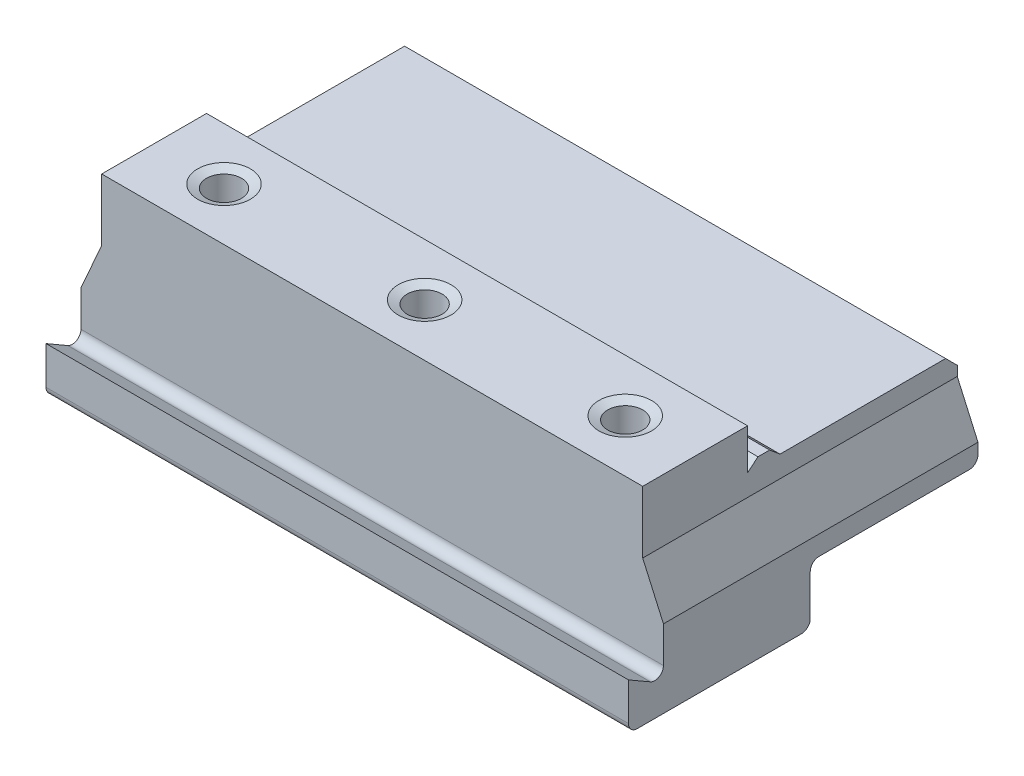
ISO-10303-21;
HEADER;
FILE_DESCRIPTION(('STEP AP214'),'2;1');
FILE_NAME('part.step','',(''),(''),'','','');
FILE_SCHEMA(('AUTOMOTIVE_DESIGN { 1 0 10303 214 1 1 1 1 }'));
ENDSEC;
DATA;
#1=APPLICATION_CONTEXT('core data for automotive mechanical design processes');
#2=APPLICATION_PROTOCOL_DEFINITION('international standard','automotive_design',2000,#1);
#3=PRODUCT_CONTEXT('',#1,'mechanical');
#4=PRODUCT('Part','Part','',(#3));
#5=PRODUCT_RELATED_PRODUCT_CATEGORY('part','',(#4));
#6=PRODUCT_DEFINITION_FORMATION('','',#4);
#7=PRODUCT_DEFINITION_CONTEXT('part definition',#1,'design');
#8=PRODUCT_DEFINITION('design','',#6,#7);
#9=PRODUCT_DEFINITION_SHAPE('','',#8);
#10=(LENGTH_UNIT() NAMED_UNIT(*) SI_UNIT(.MILLI.,.METRE.));
#11=(NAMED_UNIT(*) PLANE_ANGLE_UNIT() SI_UNIT($,.RADIAN.));
#12=(NAMED_UNIT(*) SI_UNIT($,.STERADIAN.) SOLID_ANGLE_UNIT());
#13=UNCERTAINTY_MEASURE_WITH_UNIT(LENGTH_MEASURE(1.E-05),#10,'distance_accuracy_value','');
#14=(GEOMETRIC_REPRESENTATION_CONTEXT(3) GLOBAL_UNCERTAINTY_ASSIGNED_CONTEXT((#13)) GLOBAL_UNIT_ASSIGNED_CONTEXT((#10,
#11,#12)) REPRESENTATION_CONTEXT('',''));
#15=CARTESIAN_POINT('',(0.,0.,0.));
#16=DIRECTION('',(0.,0.,1.));
#17=DIRECTION('',(1.,0.,0.));
#18=AXIS2_PLACEMENT_3D('',#15,#16,#17);
#19=CARTESIAN_POINT('',(100.,-11.4150635094611,2.25));
#20=DIRECTION('',(0.,-0.866025403784436,0.500000000000005));
#21=DIRECTION('',(0.,-0.500000000000005,-0.866025403784436));
#22=AXIS2_PLACEMENT_3D('',#19,#20,#21);
#23=PLANE('',#22);
#24=DIRECTION('',(0.,0.500000000000005,0.866025403784436));
#25=VECTOR('',#24,1.);
#26=CARTESIAN_POINT('',(0.,-11.4150635094611,2.25));
#27=LINE('',#26,#25);
#28=CARTESIAN_POINT('',(0.,-11.4150635094611,2.25));
#29=VERTEX_POINT('',#28);
#30=CARTESIAN_POINT('',(0.,-9.25000000000001,6.));
#31=VERTEX_POINT('',#30);
#32=EDGE_CURVE('E281',#29,#31,#27,.T.);
#33=ORIENTED_EDGE('',*,*,#32,.T.);
#34=DIRECTION('',(-1.,0.,0.));
#35=VECTOR('',#34,1.);
#36=CARTESIAN_POINT('',(100.,-9.25000000000001,6.));
#37=LINE('',#36,#35);
#38=CARTESIAN_POINT('',(100.,-9.25000000000001,6.));
#39=VERTEX_POINT('',#38);
#40=EDGE_CURVE('E387',#39,#31,#37,.T.);
#41=ORIENTED_EDGE('',*,*,#40,.F.);
#42=DIRECTION('',(0.,0.500000000000005,0.866025403784436));
#43=VECTOR('',#42,1.);
#44=CARTESIAN_POINT('',(100.,-11.4150635094611,2.25));
#45=LINE('',#44,#43);
#46=CARTESIAN_POINT('',(100.,-11.4150635094611,2.25));
#47=VERTEX_POINT('',#46);
#48=EDGE_CURVE('E282',#47,#39,#45,.T.);
#49=ORIENTED_EDGE('',*,*,#48,.F.);
#50=DIRECTION('',(-1.,0.,0.));
#51=VECTOR('',#50,1.);
#52=CARTESIAN_POINT('',(100.,-11.4150635094611,2.25));
#53=LINE('',#52,#51);
#54=EDGE_CURVE('E309',#47,#29,#53,.T.);
#55=ORIENTED_EDGE('',*,*,#54,.T.);
#56=EDGE_LOOP('',(#33,#41,#49,#55));
#57=FACE_BOUND('',#56,.T.);
#58=ADVANCED_FACE('F35',(#57),#23,.F.);
#59=CARTESIAN_POINT('',(100.,-9.25000000000001,6.));
#60=DIRECTION('',(0.,0.,-1.));
#61=DIRECTION('',(-1.,0.,0.));
#62=AXIS2_PLACEMENT_3D('',#59,#60,#61);
#63=PLANE('',#62);
#64=DIRECTION('',(0.,-1.,0.));
#65=VECTOR('',#64,1.);
#66=CARTESIAN_POINT('',(0.,-9.25000000000001,6.));
#67=LINE('',#66,#65);
#68=CARTESIAN_POINT('',(0.,-15.75,6.));
#69=VERTEX_POINT('',#68);
#70=EDGE_CURVE('E312',#31,#69,#67,.T.);
#71=ORIENTED_EDGE('',*,*,#70,.T.);
#72=DIRECTION('',(-1.,0.,0.));
#73=VECTOR('',#72,1.);
#74=CARTESIAN_POINT('',(100.,-15.75,6.));
#75=LINE('',#74,#73);
#76=CARTESIAN_POINT('',(100.,-15.75,6.));
#77=VERTEX_POINT('',#76);
#78=EDGE_CURVE('E384',#77,#69,#75,.T.);
#79=ORIENTED_EDGE('',*,*,#78,.F.);
#80=DIRECTION('',(0.,-1.,0.));
#81=VECTOR('',#80,1.);
#82=CARTESIAN_POINT('',(100.,-9.25000000000001,6.));
#83=LINE('',#82,#81);
#84=EDGE_CURVE('E285',#39,#77,#83,.T.);
#85=ORIENTED_EDGE('',*,*,#84,.F.);
#86=ORIENTED_EDGE('',*,*,#40,.T.);
#87=EDGE_LOOP('',(#71,#79,#85,#86));
#88=FACE_BOUND('',#87,.T.);
#89=ADVANCED_FACE('F426',(#88),#63,.F.);
#90=CARTESIAN_POINT('',(100.,-15.75,4.5));
#91=DIRECTION('',(-1.,0.,0.));
#92=DIRECTION('',(0.,0.,1.));
#93=AXIS2_PLACEMENT_3D('',#90,#91,#92);
#94=CYLINDRICAL_SURFACE('',#93,1.5);
#95=CARTESIAN_POINT('',(0.,-15.75,4.5));
#96=DIRECTION('',(1.,0.,0.));
#97=DIRECTION('',(0.,0.,-1.));
#98=AXIS2_PLACEMENT_3D('',#95,#96,#97);
#99=CIRCLE('',#98,1.5);
#100=CARTESIAN_POINT('',(0.,-17.25,4.5));
#101=VERTEX_POINT('',#100);
#102=EDGE_CURVE('E314',#69,#101,#99,.T.);
#103=ORIENTED_EDGE('',*,*,#102,.T.);
#104=DIRECTION('',(-1.,0.,0.));
#105=VECTOR('',#104,1.);
#106=CARTESIAN_POINT('',(100.,-17.25,4.5));
#107=LINE('',#106,#105);
#108=CARTESIAN_POINT('',(100.,-17.25,4.5));
#109=VERTEX_POINT('',#108);
#110=EDGE_CURVE('E381',#109,#101,#107,.T.);
#111=ORIENTED_EDGE('',*,*,#110,.F.);
#112=CARTESIAN_POINT('',(100.,-15.75,4.5));
#113=DIRECTION('',(1.,0.,0.));
#114=DIRECTION('',(0.,0.,-1.));
#115=AXIS2_PLACEMENT_3D('',#112,#113,#114);
#116=CIRCLE('',#115,1.5);
#117=EDGE_CURVE('E288',#77,#109,#116,.T.);
#118=ORIENTED_EDGE('',*,*,#117,.F.);
#119=ORIENTED_EDGE('',*,*,#78,.T.);
#120=EDGE_LOOP('',(#103,#111,#118,#119));
#121=FACE_BOUND('',#120,.T.);
#122=ADVANCED_FACE('F432',(#121),#94,.T.);
#123=CARTESIAN_POINT('',(100.,-17.25,4.5));
#124=DIRECTION('',(0.,1.,0.));
#125=DIRECTION('',(0.,0.,1.));
#126=AXIS2_PLACEMENT_3D('',#123,#124,#125);
#127=PLANE('',#126);
#128=DIRECTION('',(0.,0.,-1.));
#129=VECTOR('',#128,1.);
#130=CARTESIAN_POINT('',(0.,-17.25,4.5));
#131=LINE('',#130,#129);
#132=CARTESIAN_POINT('',(0.,-17.25,-23.7));
#133=VERTEX_POINT('',#132);
#134=EDGE_CURVE('E316',#101,#133,#131,.T.);
#135=ORIENTED_EDGE('',*,*,#134,.T.);
#136=DIRECTION('',(-1.,0.,0.));
#137=VECTOR('',#136,1.);
#138=CARTESIAN_POINT('',(100.,-17.25,-23.7));
#139=LINE('',#138,#137);
#140=CARTESIAN_POINT('',(100.,-17.25,-23.7));
#141=VERTEX_POINT('',#140);
#142=EDGE_CURVE('E378',#141,#133,#139,.T.);
#143=ORIENTED_EDGE('',*,*,#142,.F.);
#144=DIRECTION('',(0.,0.,-1.));
#145=VECTOR('',#144,1.);
#146=CARTESIAN_POINT('',(100.,-17.25,4.5));
#147=LINE('',#146,#145);
#148=EDGE_CURVE('E290',#109,#141,#147,.T.);
#149=ORIENTED_EDGE('',*,*,#148,.F.);
#150=ORIENTED_EDGE('',*,*,#110,.T.);
#151=EDGE_LOOP('',(#135,#143,#149,#150));
#152=FACE_BOUND('',#151,.T.);
#153=ADVANCED_FACE('F445',(#152),#127,.F.);
#154=CARTESIAN_POINT('',(100.,-15.75,-23.7));
#155=DIRECTION('',(-1.,0.,0.));
#156=DIRECTION('',(0.,0.,1.));
#157=AXIS2_PLACEMENT_3D('',#154,#155,#156);
#158=CYLINDRICAL_SURFACE('',#157,1.5);
#159=CARTESIAN_POINT('',(0.,-15.75,-23.7));
#160=DIRECTION('',(1.,0.,0.));
#161=DIRECTION('',(0.,0.,-1.));
#162=AXIS2_PLACEMENT_3D('',#159,#160,#161);
#163=CIRCLE('',#162,1.5);
#164=CARTESIAN_POINT('',(0.,-15.75,-25.2));
#165=VERTEX_POINT('',#164);
#166=EDGE_CURVE('E318',#133,#165,#163,.T.);
#167=ORIENTED_EDGE('',*,*,#166,.T.);
#168=DIRECTION('',(-1.,0.,0.));
#169=VECTOR('',#168,1.);
#170=CARTESIAN_POINT('',(100.,-15.75,-25.2));
#171=LINE('',#170,#169);
#172=CARTESIAN_POINT('',(100.,-15.75,-25.2));
#173=VERTEX_POINT('',#172);
#174=EDGE_CURVE('E375',#173,#165,#171,.T.);
#175=ORIENTED_EDGE('',*,*,#174,.F.);
#176=CARTESIAN_POINT('',(100.,-15.75,-23.7));
#177=DIRECTION('',(1.,0.,0.));
#178=DIRECTION('',(0.,0.,-1.));
#179=AXIS2_PLACEMENT_3D('',#176,#177,#178);
#180=CIRCLE('',#179,1.5);
#181=EDGE_CURVE('E292',#141,#173,#180,.T.);
#182=ORIENTED_EDGE('',*,*,#181,.F.);
#183=ORIENTED_EDGE('',*,*,#142,.T.);
#184=EDGE_LOOP('',(#167,#175,#182,#183));
#185=FACE_BOUND('',#184,.T.);
#186=ADVANCED_FACE('F449',(#185),#158,.T.);
#187=CARTESIAN_POINT('',(100.,-15.75,-25.2));
#188=DIRECTION('',(0.,0.,1.));
#189=DIRECTION('',(0.,-1.,0.));
#190=AXIS2_PLACEMENT_3D('',#187,#188,#189);
#191=PLANE('',#190);
#192=DIRECTION('',(0.,1.,0.));
#193=VECTOR('',#192,1.);
#194=CARTESIAN_POINT('',(0.,-15.75,-25.2));
#195=LINE('',#194,#193);
#196=CARTESIAN_POINT('',(0.,-8.75000000000001,-25.2));
#197=VERTEX_POINT('',#196);
#198=EDGE_CURVE('E320',#165,#197,#195,.T.);
#199=ORIENTED_EDGE('',*,*,#198,.T.);
#200=DIRECTION('',(-1.,0.,0.));
#201=VECTOR('',#200,1.);
#202=CARTESIAN_POINT('',(100.,-8.75000000000001,-25.2));
#203=LINE('',#202,#201);
#204=CARTESIAN_POINT('',(100.,-8.75000000000001,-25.2));
#205=VERTEX_POINT('',#204);
#206=EDGE_CURVE('E372',#205,#197,#203,.T.);
#207=ORIENTED_EDGE('',*,*,#206,.F.);
#208=DIRECTION('',(0.,1.,0.));
#209=VECTOR('',#208,1.);
#210=CARTESIAN_POINT('',(100.,-15.75,-25.2));
#211=LINE('',#210,#209);
#212=EDGE_CURVE('E294',#173,#205,#211,.T.);
#213=ORIENTED_EDGE('',*,*,#212,.F.);
#214=ORIENTED_EDGE('',*,*,#174,.T.);
#215=EDGE_LOOP('',(#199,#207,#213,#214));
#216=FACE_BOUND('',#215,.T.);
#217=ADVANCED_FACE('F453',(#216),#191,.F.);
#218=CARTESIAN_POINT('',(100.,-8.75000000000001,-26.7));
#219=DIRECTION('',(-1.,0.,0.));
#220=DIRECTION('',(0.,0.,1.));
#221=AXIS2_PLACEMENT_3D('',#218,#219,#220);
#222=CYLINDRICAL_SURFACE('',#221,1.5);
#223=CARTESIAN_POINT('',(0.,-8.75000000000001,-26.7));
#224=DIRECTION('',(-1.,0.,0.));
#225=DIRECTION('',(0.,0.,1.));
#226=AXIS2_PLACEMENT_3D('',#223,#224,#225);
#227=CIRCLE('',#226,1.5);
#228=CARTESIAN_POINT('',(0.,-7.25000000000001,-26.7));
#229=VERTEX_POINT('',#228);
#230=EDGE_CURVE('E322',#197,#229,#227,.T.);
#231=ORIENTED_EDGE('',*,*,#230,.T.);
#232=DIRECTION('',(-1.,0.,0.));
#233=VECTOR('',#232,1.);
#234=CARTESIAN_POINT('',(100.,-7.25000000000001,-26.7));
#235=LINE('',#234,#233);
#236=CARTESIAN_POINT('',(100.,-7.25000000000001,-26.7));
#237=VERTEX_POINT('',#236);
#238=EDGE_CURVE('E369',#237,#229,#235,.T.);
#239=ORIENTED_EDGE('',*,*,#238,.F.);
#240=CARTESIAN_POINT('',(100.,-8.75000000000001,-26.7));
#241=DIRECTION('',(-1.,0.,0.));
#242=DIRECTION('',(0.,0.,1.));
#243=AXIS2_PLACEMENT_3D('',#240,#241,#242);
#244=CIRCLE('',#243,1.5);
#245=EDGE_CURVE('E296',#205,#237,#244,.T.);
#246=ORIENTED_EDGE('',*,*,#245,.F.);
#247=ORIENTED_EDGE('',*,*,#206,.T.);
#248=EDGE_LOOP('',(#231,#239,#246,#247));
#249=FACE_BOUND('',#248,.T.);
#250=ADVANCED_FACE('F457',(#249),#222,.F.);
#251=CARTESIAN_POINT('',(100.,-7.25000000000001,-26.7));
#252=DIRECTION('',(0.,1.,0.));
#253=DIRECTION('',(0.,0.,1.));
#254=AXIS2_PLACEMENT_3D('',#251,#252,#253);
#255=PLANE('',#254);
#256=DIRECTION('',(0.,0.,-1.));
#257=VECTOR('',#256,1.);
#258=CARTESIAN_POINT('',(0.,-7.25000000000001,-26.7));
#259=LINE('',#258,#257);
#260=CARTESIAN_POINT('',(0.,-7.25000000000001,-52.5));
#261=VERTEX_POINT('',#260);
#262=EDGE_CURVE('E324',#229,#261,#259,.T.);
#263=ORIENTED_EDGE('',*,*,#262,.T.);
#264=DIRECTION('',(-1.,0.,0.));
#265=VECTOR('',#264,1.);
#266=CARTESIAN_POINT('',(100.,-7.25000000000001,-52.5));
#267=LINE('',#266,#265);
#268=CARTESIAN_POINT('',(100.,-7.25000000000001,-52.5));
#269=VERTEX_POINT('',#268);
#270=EDGE_CURVE('E366',#269,#261,#267,.T.);
#271=ORIENTED_EDGE('',*,*,#270,.F.);
#272=DIRECTION('',(0.,0.,-1.));
#273=VECTOR('',#272,1.);
#274=CARTESIAN_POINT('',(100.,-7.25000000000001,-26.7));
#275=LINE('',#274,#273);
#276=EDGE_CURVE('E298',#237,#269,#275,.T.);
#277=ORIENTED_EDGE('',*,*,#276,.F.);
#278=ORIENTED_EDGE('',*,*,#238,.T.);
#279=EDGE_LOOP('',(#263,#271,#277,#278));
#280=FACE_BOUND('',#279,.T.);
#281=ADVANCED_FACE('F461',(#280),#255,.F.);
#282=CARTESIAN_POINT('',(100.,-5.75000000000001,-52.5));
#283=DIRECTION('',(-1.,0.,0.));
#284=DIRECTION('',(0.,0.,1.));
#285=AXIS2_PLACEMENT_3D('',#282,#283,#284);
#286=CYLINDRICAL_SURFACE('',#285,1.5);
#287=CARTESIAN_POINT('',(0.,-5.75000000000001,-52.5));
#288=DIRECTION('',(1.,0.,0.));
#289=DIRECTION('',(0.,0.,-1.));
#290=AXIS2_PLACEMENT_3D('',#287,#288,#289);
#291=CIRCLE('',#290,1.5);
#292=CARTESIAN_POINT('',(0.,-5.75000000000001,-54.));
#293=VERTEX_POINT('',#292);
#294=EDGE_CURVE('E326',#261,#293,#291,.T.);
#295=ORIENTED_EDGE('',*,*,#294,.T.);
#296=DIRECTION('',(-1.,0.,0.));
#297=VECTOR('',#296,1.);
#298=CARTESIAN_POINT('',(100.,-5.75000000000001,-54.));
#299=LINE('',#298,#297);
#300=CARTESIAN_POINT('',(100.,-5.75000000000001,-54.));
#301=VERTEX_POINT('',#300);
#302=EDGE_CURVE('E363',#301,#293,#299,.T.);
#303=ORIENTED_EDGE('',*,*,#302,.F.);
#304=CARTESIAN_POINT('',(100.,-5.75000000000001,-52.5));
#305=DIRECTION('',(1.,0.,0.));
#306=DIRECTION('',(0.,0.,-1.));
#307=AXIS2_PLACEMENT_3D('',#304,#305,#306);
#308=CIRCLE('',#307,1.5);
#309=EDGE_CURVE('E300',#269,#301,#308,.T.);
#310=ORIENTED_EDGE('',*,*,#309,.F.);
#311=ORIENTED_EDGE('',*,*,#270,.T.);
#312=EDGE_LOOP('',(#295,#303,#310,#311));
#313=FACE_BOUND('',#312,.T.);
#314=ADVANCED_FACE('F465',(#313),#286,.T.);
#315=CARTESIAN_POINT('',(100.,-5.75000000000001,-54.));
#316=DIRECTION('',(0.,0.,1.));
#317=DIRECTION('',(1.,0.,0.));
#318=AXIS2_PLACEMENT_3D('',#315,#316,#317);
#319=PLANE('',#318);
#320=DIRECTION('',(0.,-1.,0.));
#321=VECTOR('',#320,1.);
#322=CARTESIAN_POINT('',(96.4381705175318,14.75,-54.));
#323=LINE('',#322,#321);
#324=CARTESIAN_POINT('',(96.4381705175318,5.74999999999999,-54.));
#325=VERTEX_POINT('',#324);
#326=CARTESIAN_POINT('',(96.4381705175318,4.08333333333333,-54.));
#327=VERTEX_POINT('',#326);
#328=EDGE_CURVE('E217',#325,#327,#323,.T.);
#329=ORIENTED_EDGE('',*,*,#328,.T.);
#330=DIRECTION('',(0.406736643075795,-0.913545457642603,0.));
#331=VECTOR('',#330,1.);
#332=CARTESIAN_POINT('',(96.4381705175318,4.08333333333333,-54.));
#333=LINE('',#332,#331);
#334=CARTESIAN_POINT('',(100.,-3.91666666666667,-54.));
#335=VERTEX_POINT('',#334);
#336=EDGE_CURVE('E220',#327,#335,#333,.T.);
#337=ORIENTED_EDGE('',*,*,#336,.T.);
#338=DIRECTION('',(0.,1.,0.));
#339=VECTOR('',#338,1.);
#340=CARTESIAN_POINT('',(100.,-5.75000000000001,-54.));
#341=LINE('',#340,#339);
#342=EDGE_CURVE('E302',#301,#335,#341,.T.);
#343=ORIENTED_EDGE('',*,*,#342,.F.);
#344=ORIENTED_EDGE('',*,*,#302,.T.);
#345=DIRECTION('',(0.,1.,0.));
#346=VECTOR('',#345,1.);
#347=CARTESIAN_POINT('',(0.,-5.75000000000001,-54.));
#348=LINE('',#347,#346);
#349=CARTESIAN_POINT('',(0.,-3.91666666666667,-54.));
#350=VERTEX_POINT('',#349);
#351=EDGE_CURVE('E328',#293,#350,#348,.T.);
#352=ORIENTED_EDGE('',*,*,#351,.T.);
#353=DIRECTION('',(0.406736643075795,0.913545457642603,0.));
#354=VECTOR('',#353,1.);
#355=CARTESIAN_POINT('',(3.56182948246823,4.08333333333333,-54.));
#356=LINE('',#355,#354);
#357=CARTESIAN_POINT('',(3.56182948246823,4.08333333333333,-54.));
#358=VERTEX_POINT('',#357);
#359=EDGE_CURVE('E59',#350,#358,#356,.T.);
#360=ORIENTED_EDGE('',*,*,#359,.T.);
#361=DIRECTION('',(0.,1.,0.));
#362=VECTOR('',#361,1.);
#363=CARTESIAN_POINT('',(3.56182948246823,14.75,-54.));
#364=LINE('',#363,#362);
#365=CARTESIAN_POINT('',(3.56182948246823,5.74999999999999,-54.));
#366=VERTEX_POINT('',#365);
#367=EDGE_CURVE('E232',#358,#366,#364,.T.);
#368=ORIENTED_EDGE('',*,*,#367,.T.);
#369=DIRECTION('',(-1.,0.,0.));
#370=VECTOR('',#369,1.);
#371=CARTESIAN_POINT('',(100.,5.74999999999999,-54.));
#372=LINE('',#371,#370);
#373=EDGE_CURVE('E360',#325,#366,#372,.T.);
#374=ORIENTED_EDGE('',*,*,#373,.F.);
#375=EDGE_LOOP('',(#329,#337,#343,#344,#352,#360,#368,#374));
#376=FACE_BOUND('',#375,.T.);
#377=ADVANCED_FACE('F469',(#376),#319,.F.);
#378=CARTESIAN_POINT('',(100.,5.74999999999999,-54.));
#379=DIRECTION('',(0.,-0.707106781186548,0.707106781186547));
#380=DIRECTION('',(0.,-0.707106781186547,-0.707106781186548));
#381=AXIS2_PLACEMENT_3D('',#378,#379,#380);
#382=PLANE('',#381);
#383=DIRECTION('',(-1.,0.,0.));
#384=VECTOR('',#383,1.);
#385=CARTESIAN_POINT('',(100.,7.74999999999999,-52.));
#386=LINE('',#385,#384);
#387=CARTESIAN_POINT('',(96.4381705175318,7.74999999999999,-52.));
#388=VERTEX_POINT('',#387);
#389=CARTESIAN_POINT('',(3.56182948246823,7.74999999999999,-52.));
#390=VERTEX_POINT('',#389);
#391=EDGE_CURVE('E357',#388,#390,#386,.T.);
#392=ORIENTED_EDGE('',*,*,#391,.F.);
#393=DIRECTION('',(0.,-0.707106781186547,-0.707106781186548));
#394=VECTOR('',#393,1.);
#395=CARTESIAN_POINT('',(96.4381705175318,5.74999999999999,-54.));
#396=LINE('',#395,#394);
#397=EDGE_CURVE('E278',#388,#325,#396,.T.);
#398=ORIENTED_EDGE('',*,*,#397,.T.);
#399=ORIENTED_EDGE('',*,*,#373,.T.);
#400=DIRECTION('',(0.,0.707106781186547,0.707106781186548));
#401=VECTOR('',#400,1.);
#402=CARTESIAN_POINT('',(3.56182948246823,5.74999999999999,-54.));
#403=LINE('',#402,#401);
#404=EDGE_CURVE('E260',#366,#390,#403,.T.);
#405=ORIENTED_EDGE('',*,*,#404,.T.);
#406=EDGE_LOOP('',(#392,#398,#399,#405));
#407=FACE_BOUND('',#406,.T.);
#408=ADVANCED_FACE('F473',(#407),#382,.F.);
#409=CARTESIAN_POINT('',(100.,7.74999999999999,-52.));
#410=DIRECTION('',(0.,-1.,0.));
#411=DIRECTION('',(0.,0.,-1.));
#412=AXIS2_PLACEMENT_3D('',#409,#410,#411);
#413=PLANE('',#412);
#414=DIRECTION('',(-1.,0.,0.));
#415=VECTOR('',#414,1.);
#416=CARTESIAN_POINT('',(100.,7.74999999999999,-23.5752607777826));
#417=LINE('',#416,#415);
#418=CARTESIAN_POINT('',(96.4381705175318,7.74999999999999,-23.5752607777826));
#419=VERTEX_POINT('',#418);
#420=CARTESIAN_POINT('',(3.56182948246823,7.74999999999999,-23.5752607777826));
#421=VERTEX_POINT('',#420);
#422=EDGE_CURVE('E354',#419,#421,#417,.T.);
#423=ORIENTED_EDGE('',*,*,#422,.F.);
#424=DIRECTION('',(0.,0.,-1.));
#425=VECTOR('',#424,1.);
#426=CARTESIAN_POINT('',(96.4381705175318,7.74999999999999,-52.));
#427=LINE('',#426,#425);
#428=EDGE_CURVE('E275',#419,#388,#427,.T.);
#429=ORIENTED_EDGE('',*,*,#428,.T.);
#430=ORIENTED_EDGE('',*,*,#391,.T.);
#431=DIRECTION('',(0.,0.,1.));
#432=VECTOR('',#431,1.);
#433=CARTESIAN_POINT('',(3.56182948246823,7.74999999999999,-52.));
#434=LINE('',#433,#432);
#435=EDGE_CURVE('E257',#390,#421,#434,.T.);
#436=ORIENTED_EDGE('',*,*,#435,.T.);
#437=EDGE_LOOP('',(#423,#429,#430,#436));
#438=FACE_BOUND('',#437,.T.);
#439=ADVANCED_FACE('F477',(#438),#413,.F.);
#440=CARTESIAN_POINT('',(100.,7.74999999999999,-23.5752607777826));
#441=DIRECTION('',(0.,-0.766044443118977,0.642787609686541));
#442=DIRECTION('',(0.,-0.642787609686541,-0.766044443118977));
#443=AXIS2_PLACEMENT_3D('',#440,#441,#442);
#444=PLANE('',#443);
#445=DIRECTION('',(-1.,0.,0.));
#446=VECTOR('',#445,1.);
#447=CARTESIAN_POINT('',(100.,9.24999999999999,-21.7876303888913));
#448=LINE('',#447,#446);
#449=CARTESIAN_POINT('',(96.4381705175318,9.24999999999999,-21.7876303888913));
#450=VERTEX_POINT('',#449);
#451=CARTESIAN_POINT('',(3.56182948246823,9.24999999999999,-21.7876303888913));
#452=VERTEX_POINT('',#451);
#453=EDGE_CURVE('E351',#450,#452,#448,.T.);
#454=ORIENTED_EDGE('',*,*,#453,.F.);
#455=DIRECTION('',(0.,-0.642787609686541,-0.766044443118977));
#456=VECTOR('',#455,1.);
#457=CARTESIAN_POINT('',(96.4381705175318,7.74999999999999,-23.5752607777826));
#458=LINE('',#457,#456);
#459=EDGE_CURVE('E272',#450,#419,#458,.T.);
#460=ORIENTED_EDGE('',*,*,#459,.T.);
#461=ORIENTED_EDGE('',*,*,#422,.T.);
#462=DIRECTION('',(0.,0.642787609686541,0.766044443118977));
#463=VECTOR('',#462,1.);
#464=CARTESIAN_POINT('',(3.56182948246823,7.74999999999999,-23.5752607777826));
#465=LINE('',#464,#463);
#466=EDGE_CURVE('E254',#421,#452,#465,.T.);
#467=ORIENTED_EDGE('',*,*,#466,.T.);
#468=EDGE_LOOP('',(#454,#460,#461,#467));
#469=FACE_BOUND('',#468,.T.);
#470=ADVANCED_FACE('F481',(#469),#444,.F.);
#471=CARTESIAN_POINT('',(100.,9.24999999999999,-21.7876303888913));
#472=DIRECTION('',(0.,-1.,0.));
#473=DIRECTION('',(0.,0.,-1.));
#474=AXIS2_PLACEMENT_3D('',#471,#472,#473);
#475=PLANE('',#474);
#476=DIRECTION('',(-1.,0.,0.));
#477=VECTOR('',#476,1.);
#478=CARTESIAN_POINT('',(100.,9.24999999999999,-19.7876303888913));
#479=LINE('',#478,#477);
#480=CARTESIAN_POINT('',(96.4381705175318,9.25,-19.7876303888913));
#481=VERTEX_POINT('',#480);
#482=CARTESIAN_POINT('',(3.56182948246823,9.25,-19.7876303888913));
#483=VERTEX_POINT('',#482);
#484=EDGE_CURVE('E348',#481,#483,#479,.T.);
#485=ORIENTED_EDGE('',*,*,#484,.F.);
#486=DIRECTION('',(0.,0.,-1.));
#487=VECTOR('',#486,1.);
#488=CARTESIAN_POINT('',(96.4381705175318,9.24999999999999,-21.7876303888913));
#489=LINE('',#488,#487);
#490=EDGE_CURVE('E269',#481,#450,#489,.T.);
#491=ORIENTED_EDGE('',*,*,#490,.T.);
#492=ORIENTED_EDGE('',*,*,#453,.T.);
#493=DIRECTION('',(0.,0.,1.));
#494=VECTOR('',#493,1.);
#495=CARTESIAN_POINT('',(3.56182948246823,9.24999999999999,-21.7876303888913));
#496=LINE('',#495,#494);
#497=EDGE_CURVE('E251',#452,#483,#496,.T.);
#498=ORIENTED_EDGE('',*,*,#497,.T.);
#499=EDGE_LOOP('',(#485,#491,#492,#498));
#500=FACE_BOUND('',#499,.T.);
#501=ADVANCED_FACE('F485',(#500),#475,.F.);
#502=CARTESIAN_POINT('',(100.,9.24999999999999,-19.7876303888913));
#503=DIRECTION('',(0.,-0.766044443118977,-0.642787609686541));
#504=DIRECTION('',(0.,0.642787609686541,-0.766044443118977));
#505=AXIS2_PLACEMENT_3D('',#502,#503,#504);
#506=PLANE('',#505);
#507=DIRECTION('',(-1.,0.,0.));
#508=VECTOR('',#507,1.);
#509=CARTESIAN_POINT('',(100.,7.74999999999999,-18.));
#510=LINE('',#509,#508);
#511=CARTESIAN_POINT('',(96.4381705175318,7.74999999999999,-18.));
#512=VERTEX_POINT('',#511);
#513=CARTESIAN_POINT('',(3.56182948246823,7.74999999999999,-18.));
#514=VERTEX_POINT('',#513);
#515=EDGE_CURVE('E345',#512,#514,#510,.T.);
#516=ORIENTED_EDGE('',*,*,#515,.F.);
#517=DIRECTION('',(0.,0.642787609686541,-0.766044443118977));
#518=VECTOR('',#517,1.);
#519=CARTESIAN_POINT('',(96.4381705175318,9.24999999999999,-19.7876303888913));
#520=LINE('',#519,#518);
#521=EDGE_CURVE('E266',#512,#481,#520,.T.);
#522=ORIENTED_EDGE('',*,*,#521,.T.);
#523=ORIENTED_EDGE('',*,*,#484,.T.);
#524=DIRECTION('',(0.,-0.642787609686541,0.766044443118977));
#525=VECTOR('',#524,1.);
#526=CARTESIAN_POINT('',(3.56182948246823,9.24999999999999,-19.7876303888913));
#527=LINE('',#526,#525);
#528=EDGE_CURVE('E248',#483,#514,#527,.T.);
#529=ORIENTED_EDGE('',*,*,#528,.T.);
#530=EDGE_LOOP('',(#516,#522,#523,#529));
#531=FACE_BOUND('',#530,.T.);
#532=ADVANCED_FACE('F489',(#531),#506,.F.);
#533=CARTESIAN_POINT('',(100.,7.74999999999999,-18.));
#534=DIRECTION('',(0.,0.,1.));
#535=DIRECTION('',(0.,-1.,0.));
#536=AXIS2_PLACEMENT_3D('',#533,#534,#535);
#537=PLANE('',#536);
#538=DIRECTION('',(-1.,0.,0.));
#539=VECTOR('',#538,1.);
#540=CARTESIAN_POINT('',(100.,14.75,-18.));
#541=LINE('',#540,#539);
#542=CARTESIAN_POINT('',(96.4381705175318,14.75,-18.));
#543=VERTEX_POINT('',#542);
#544=CARTESIAN_POINT('',(3.56182948246823,14.75,-18.));
#545=VERTEX_POINT('',#544);
#546=EDGE_CURVE('E342',#543,#545,#541,.T.);
#547=ORIENTED_EDGE('',*,*,#546,.F.);
#548=DIRECTION('',(0.,-1.,0.));
#549=VECTOR('',#548,1.);
#550=CARTESIAN_POINT('',(96.4381705175318,7.74999999999999,-18.));
#551=LINE('',#550,#549);
#552=EDGE_CURVE('E263',#543,#512,#551,.T.);
#553=ORIENTED_EDGE('',*,*,#552,.T.);
#554=ORIENTED_EDGE('',*,*,#515,.T.);
#555=DIRECTION('',(0.,1.,0.));
#556=VECTOR('',#555,1.);
#557=CARTESIAN_POINT('',(3.56182948246823,7.74999999999999,-18.));
#558=LINE('',#557,#556);
#559=EDGE_CURVE('E245',#514,#545,#558,.T.);
#560=ORIENTED_EDGE('',*,*,#559,.T.);
#561=EDGE_LOOP('',(#547,#553,#554,#560));
#562=FACE_BOUND('',#561,.T.);
#563=ADVANCED_FACE('F493',(#562),#537,.F.);
#564=CARTESIAN_POINT('',(100.,14.75,-18.));
#565=DIRECTION('',(0.,-1.,0.));
#566=DIRECTION('',(0.,0.,-1.));
#567=AXIS2_PLACEMENT_3D('',#564,#565,#566);
#568=PLANE('',#567);
#569=CARTESIAN_POINT('',(84.4381705175318,14.75,-9.));
#570=DIRECTION('',(0.,-1.,0.));
#571=DIRECTION('',(0.,0.,-1.));
#572=AXIS2_PLACEMENT_3D('',#569,#570,#571);
#573=CIRCLE('',#572,4.52500000000001);
#574=CARTESIAN_POINT('',(84.4381705175318,14.75,-13.525));
#575=VERTEX_POINT('',#574);
#576=EDGE_CURVE('E405',#575,#575,#573,.T.);
#577=ORIENTED_EDGE('',*,*,#576,.T.);
#578=EDGE_LOOP('',(#577));
#579=FACE_BOUND('',#578,.T.);
#580=CARTESIAN_POINT('',(50.,14.75,-9.));
#581=DIRECTION('',(0.,-1.,0.));
#582=DIRECTION('',(0.,0.,-1.));
#583=AXIS2_PLACEMENT_3D('',#580,#581,#582);
#584=CIRCLE('',#583,4.52500000000001);
#585=CARTESIAN_POINT('',(50.,14.75,-13.525));
#586=VERTEX_POINT('',#585);
#587=EDGE_CURVE('E402',#586,#586,#584,.T.);
#588=ORIENTED_EDGE('',*,*,#587,.T.);
#589=EDGE_LOOP('',(#588));
#590=FACE_BOUND('',#589,.T.);
#591=CARTESIAN_POINT('',(15.5618294824682,14.75,-9.));
#592=DIRECTION('',(0.,-1.,0.));
#593=DIRECTION('',(0.,0.,-1.));
#594=AXIS2_PLACEMENT_3D('',#591,#592,#593);
#595=CIRCLE('',#594,4.52500000000001);
#596=CARTESIAN_POINT('',(15.5618294824682,14.75,-13.525));
#597=VERTEX_POINT('',#596);
#598=EDGE_CURVE('E399',#597,#597,#595,.T.);
#599=ORIENTED_EDGE('',*,*,#598,.T.);
#600=EDGE_LOOP('',(#599));
#601=FACE_BOUND('',#600,.T.);
#602=DIRECTION('',(-1.,0.,0.));
#603=VECTOR('',#602,1.);
#604=CARTESIAN_POINT('',(100.,14.75,0.));
#605=LINE('',#604,#603);
#606=CARTESIAN_POINT('',(96.4381705175318,14.75,0.));
#607=VERTEX_POINT('',#606);
#608=CARTESIAN_POINT('',(3.56182948246823,14.75,0.));
#609=VERTEX_POINT('',#608);
#610=EDGE_CURVE('E339',#607,#609,#605,.T.);
#611=ORIENTED_EDGE('',*,*,#610,.F.);
#612=DIRECTION('',(0.,0.,1.));
#613=VECTOR('',#612,1.);
#614=CARTESIAN_POINT('',(96.4381705175318,14.75,-54.));
#615=LINE('',#614,#613);
#616=EDGE_CURVE('E224',#543,#607,#615,.T.);
#617=ORIENTED_EDGE('',*,*,#616,.F.);
#618=ORIENTED_EDGE('',*,*,#546,.T.);
#619=DIRECTION('',(0.,0.,1.));
#620=VECTOR('',#619,1.);
#621=CARTESIAN_POINT('',(3.56182948246823,14.75,-54.));
#622=LINE('',#621,#620);
#623=EDGE_CURVE('E221',#545,#609,#622,.T.);
#624=ORIENTED_EDGE('',*,*,#623,.T.);
#625=EDGE_LOOP('',(#611,#617,#618,#624));
#626=FACE_BOUND('',#625,.T.);
#627=ADVANCED_FACE('F497',(#579,#590,#601,#626),#568,.F.);
#628=CARTESIAN_POINT('',(100.,14.75,0.));
#629=DIRECTION('',(0.,0.,-1.));
#630=DIRECTION('',(0.,1.,0.));
#631=AXIS2_PLACEMENT_3D('',#628,#629,#630);
#632=PLANE('',#631);
#633=DIRECTION('',(0.,-1.,0.));
#634=VECTOR('',#633,1.);
#635=CARTESIAN_POINT('',(100.,14.75,0.));
#636=LINE('',#635,#634);
#637=CARTESIAN_POINT('',(100.,-3.91666666666667,0.));
#638=VERTEX_POINT('',#637);
#639=CARTESIAN_POINT('',(100.,-10.1160254037845,0.));
#640=VERTEX_POINT('',#639);
#641=EDGE_CURVE('E305',#638,#640,#636,.T.);
#642=ORIENTED_EDGE('',*,*,#641,.F.);
#643=DIRECTION('',(-0.406736643075795,0.913545457642603,0.));
#644=VECTOR('',#643,1.);
#645=CARTESIAN_POINT('',(93.0639816288777,11.6618856593494,0.));
#646=LINE('',#645,#644);
#647=CARTESIAN_POINT('',(96.4381705175318,4.08333333333333,0.));
#648=VERTEX_POINT('',#647);
#649=EDGE_CURVE('E51',#638,#648,#646,.T.);
#650=ORIENTED_EDGE('',*,*,#649,.T.);
#651=DIRECTION('',(0.,1.,0.));
#652=VECTOR('',#651,1.);
#653=CARTESIAN_POINT('',(96.4381705175318,14.75,0.));
#654=LINE('',#653,#652);
#655=EDGE_CURVE('E393',#648,#607,#654,.T.);
#656=ORIENTED_EDGE('',*,*,#655,.T.);
#657=ORIENTED_EDGE('',*,*,#610,.T.);
#658=DIRECTION('',(0.,-1.,0.));
#659=VECTOR('',#658,1.);
#660=CARTESIAN_POINT('',(3.56182948246823,14.75,0.));
#661=LINE('',#660,#659);
#662=CARTESIAN_POINT('',(3.56182948246823,4.08333333333333,0.));
#663=VERTEX_POINT('',#662);
#664=EDGE_CURVE('E390',#609,#663,#661,.T.);
#665=ORIENTED_EDGE('',*,*,#664,.T.);
#666=DIRECTION('',(-0.406736643075795,-0.913545457642603,0.));
#667=VECTOR('',#666,1.);
#668=CARTESIAN_POINT('',(23.4794880531789,48.8191269332188,0.));
#669=LINE('',#668,#667);
#670=CARTESIAN_POINT('',(0.,-3.91666666666667,0.));
#671=VERTEX_POINT('',#670);
#672=EDGE_CURVE('E227',#663,#671,#669,.T.);
#673=ORIENTED_EDGE('',*,*,#672,.T.);
#674=DIRECTION('',(0.,-1.,0.));
#675=VECTOR('',#674,1.);
#676=CARTESIAN_POINT('',(0.,14.75,0.));
#677=LINE('',#676,#675);
#678=CARTESIAN_POINT('',(0.,-10.1160254037845,0.));
#679=VERTEX_POINT('',#678);
#680=EDGE_CURVE('E331',#671,#679,#677,.T.);
#681=ORIENTED_EDGE('',*,*,#680,.T.);
#682=DIRECTION('',(-1.,0.,0.));
#683=VECTOR('',#682,1.);
#684=CARTESIAN_POINT('',(100.,-10.1160254037845,0.));
#685=LINE('',#684,#683);
#686=EDGE_CURVE('E336',#640,#679,#685,.T.);
#687=ORIENTED_EDGE('',*,*,#686,.F.);
#688=EDGE_LOOP('',(#642,#650,#656,#657,#665,#673,#681,#687));
#689=FACE_BOUND('',#688,.T.);
#690=ADVANCED_FACE('F501',(#689),#632,.F.);
#691=CARTESIAN_POINT('',(100.,-10.1160254037845,1.5));
#692=DIRECTION('',(-1.,0.,0.));
#693=DIRECTION('',(0.,0.,1.));
#694=AXIS2_PLACEMENT_3D('',#691,#692,#693);
#695=CYLINDRICAL_SURFACE('',#694,1.5);
#696=CARTESIAN_POINT('',(0.,-10.1160254037845,1.5));
#697=DIRECTION('',(-1.,0.,0.));
#698=DIRECTION('',(0.,0.,1.));
#699=AXIS2_PLACEMENT_3D('',#696,#697,#698);
#700=CIRCLE('',#699,1.5);
#701=EDGE_CURVE('E286',#679,#29,#700,.T.);
#702=ORIENTED_EDGE('',*,*,#701,.T.);
#703=ORIENTED_EDGE('',*,*,#54,.F.);
#704=CARTESIAN_POINT('',(100.,-10.1160254037845,1.5));
#705=DIRECTION('',(-1.,0.,0.));
#706=DIRECTION('',(0.,0.,1.));
#707=AXIS2_PLACEMENT_3D('',#704,#705,#706);
#708=CIRCLE('',#707,1.5);
#709=EDGE_CURVE('E307',#640,#47,#708,.T.);
#710=ORIENTED_EDGE('',*,*,#709,.F.);
#711=ORIENTED_EDGE('',*,*,#686,.T.);
#712=EDGE_LOOP('',(#702,#703,#710,#711));
#713=FACE_BOUND('',#712,.T.);
#714=ADVANCED_FACE('F505',(#713),#695,.F.);
#715=CARTESIAN_POINT('',(100.,-15.75,4.5));
#716=DIRECTION('',(1.,0.,0.));
#717=DIRECTION('',(0.,0.,-1.));
#718=AXIS2_PLACEMENT_3D('',#715,#716,#717);
#719=PLANE('',#718);
#720=DIRECTION('',(0.,0.,1.));
#721=VECTOR('',#720,1.);
#722=CARTESIAN_POINT('',(100.,-3.91666666666667,-54.));
#723=LINE('',#722,#721);
#724=EDGE_CURVE('E225',#335,#638,#723,.T.);
#725=ORIENTED_EDGE('',*,*,#724,.T.);
#726=ORIENTED_EDGE('',*,*,#641,.T.);
#727=ORIENTED_EDGE('',*,*,#709,.T.);
#728=ORIENTED_EDGE('',*,*,#48,.T.);
#729=ORIENTED_EDGE('',*,*,#84,.T.);
#730=ORIENTED_EDGE('',*,*,#117,.T.);
#731=ORIENTED_EDGE('',*,*,#148,.T.);
#732=ORIENTED_EDGE('',*,*,#181,.T.);
#733=ORIENTED_EDGE('',*,*,#212,.T.);
#734=ORIENTED_EDGE('',*,*,#245,.T.);
#735=ORIENTED_EDGE('',*,*,#276,.T.);
#736=ORIENTED_EDGE('',*,*,#309,.T.);
#737=ORIENTED_EDGE('',*,*,#342,.T.);
#738=EDGE_LOOP('',(#725,#726,#727,#728,#729,#730,#731,#732,#733,#734,#735,#736,#737));
#739=FACE_BOUND('',#738,.T.);
#740=ADVANCED_FACE('F509',(#739),#719,.T.);
#741=CARTESIAN_POINT('',(0.,-15.75,4.5));
#742=DIRECTION('',(1.,0.,0.));
#743=DIRECTION('',(0.,0.,-1.));
#744=AXIS2_PLACEMENT_3D('',#741,#742,#743);
#745=PLANE('',#744);
#746=ORIENTED_EDGE('',*,*,#680,.F.);
#747=DIRECTION('',(0.,0.,1.));
#748=VECTOR('',#747,1.);
#749=CARTESIAN_POINT('',(0.,-3.91666666666667,-54.));
#750=LINE('',#749,#748);
#751=EDGE_CURVE('E235',#350,#671,#750,.T.);
#752=ORIENTED_EDGE('',*,*,#751,.F.);
#753=ORIENTED_EDGE('',*,*,#351,.F.);
#754=ORIENTED_EDGE('',*,*,#294,.F.);
#755=ORIENTED_EDGE('',*,*,#262,.F.);
#756=ORIENTED_EDGE('',*,*,#230,.F.);
#757=ORIENTED_EDGE('',*,*,#198,.F.);
#758=ORIENTED_EDGE('',*,*,#166,.F.);
#759=ORIENTED_EDGE('',*,*,#134,.F.);
#760=ORIENTED_EDGE('',*,*,#102,.F.);
#761=ORIENTED_EDGE('',*,*,#70,.F.);
#762=ORIENTED_EDGE('',*,*,#32,.F.);
#763=ORIENTED_EDGE('',*,*,#701,.F.);
#764=EDGE_LOOP('',(#746,#752,#753,#754,#755,#756,#757,#758,#759,#760,#761,#762,#763));
#765=FACE_BOUND('',#764,.T.);
#766=ADVANCED_FACE('F511',(#765),#745,.F.);
#767=CARTESIAN_POINT('',(3.56182948246823,14.75,-54.));
#768=DIRECTION('',(1.,0.,0.));
#769=DIRECTION('',(0.,0.,-1.));
#770=AXIS2_PLACEMENT_3D('',#767,#768,#769);
#771=PLANE('',#770);
#772=ORIENTED_EDGE('',*,*,#367,.F.);
#773=DIRECTION('',(0.,0.,1.));
#774=VECTOR('',#773,1.);
#775=CARTESIAN_POINT('',(3.56182948246823,4.08333333333333,-54.));
#776=LINE('',#775,#774);
#777=EDGE_CURVE('E238',#358,#663,#776,.T.);
#778=ORIENTED_EDGE('',*,*,#777,.T.);
#779=ORIENTED_EDGE('',*,*,#664,.F.);
#780=ORIENTED_EDGE('',*,*,#623,.F.);
#781=ORIENTED_EDGE('',*,*,#559,.F.);
#782=ORIENTED_EDGE('',*,*,#528,.F.);
#783=ORIENTED_EDGE('',*,*,#497,.F.);
#784=ORIENTED_EDGE('',*,*,#466,.F.);
#785=ORIENTED_EDGE('',*,*,#435,.F.);
#786=ORIENTED_EDGE('',*,*,#404,.F.);
#787=EDGE_LOOP('',(#772,#778,#779,#780,#781,#782,#783,#784,#785,#786));
#788=FACE_BOUND('',#787,.T.);
#789=ADVANCED_FACE('F514',(#788),#771,.F.);
#790=CARTESIAN_POINT('',(3.56182948246823,4.08333333333333,-54.));
#791=DIRECTION('',(0.913545457642603,-0.406736643075795,0.));
#792=DIRECTION('',(0.406736643075795,0.913545457642603,0.));
#793=AXIS2_PLACEMENT_3D('',#790,#791,#792);
#794=PLANE('',#793);
#795=ORIENTED_EDGE('',*,*,#777,.F.);
#796=ORIENTED_EDGE('',*,*,#359,.F.);
#797=ORIENTED_EDGE('',*,*,#751,.T.);
#798=ORIENTED_EDGE('',*,*,#672,.F.);
#799=EDGE_LOOP('',(#795,#796,#797,#798));
#800=FACE_BOUND('',#799,.T.);
#801=ADVANCED_FACE('F519',(#800),#794,.F.);
#802=CARTESIAN_POINT('',(96.4381705175318,14.75,-54.));
#803=DIRECTION('',(-1.,0.,0.));
#804=DIRECTION('',(0.,0.,1.));
#805=AXIS2_PLACEMENT_3D('',#802,#803,#804);
#806=PLANE('',#805);
#807=ORIENTED_EDGE('',*,*,#428,.F.);
#808=ORIENTED_EDGE('',*,*,#459,.F.);
#809=ORIENTED_EDGE('',*,*,#490,.F.);
#810=ORIENTED_EDGE('',*,*,#521,.F.);
#811=ORIENTED_EDGE('',*,*,#552,.F.);
#812=ORIENTED_EDGE('',*,*,#616,.T.);
#813=ORIENTED_EDGE('',*,*,#655,.F.);
#814=DIRECTION('',(0.,0.,1.));
#815=VECTOR('',#814,1.);
#816=CARTESIAN_POINT('',(96.4381705175318,4.08333333333333,-54.));
#817=LINE('',#816,#815);
#818=EDGE_CURVE('E228',#327,#648,#817,.T.);
#819=ORIENTED_EDGE('',*,*,#818,.F.);
#820=ORIENTED_EDGE('',*,*,#328,.F.);
#821=ORIENTED_EDGE('',*,*,#397,.F.);
#822=EDGE_LOOP('',(#807,#808,#809,#810,#811,#812,#813,#819,#820,#821));
#823=FACE_BOUND('',#822,.T.);
#824=ADVANCED_FACE('F522',(#823),#806,.F.);
#825=CARTESIAN_POINT('',(96.4381705175318,4.08333333333333,-54.));
#826=DIRECTION('',(-0.913545457642603,-0.406736643075795,0.));
#827=DIRECTION('',(0.406736643075795,-0.913545457642603,0.));
#828=AXIS2_PLACEMENT_3D('',#825,#826,#827);
#829=PLANE('',#828);
#830=ORIENTED_EDGE('',*,*,#724,.F.);
#831=ORIENTED_EDGE('',*,*,#336,.F.);
#832=ORIENTED_EDGE('',*,*,#818,.T.);
#833=ORIENTED_EDGE('',*,*,#649,.F.);
#834=EDGE_LOOP('',(#830,#831,#832,#833));
#835=FACE_BOUND('',#834,.T.);
#836=ADVANCED_FACE('F528',(#835),#829,.F.);
#837=CARTESIAN_POINT('',(84.4381705175318,6.55258185708267,-9.));
#838=DIRECTION('',(0.,1.,0.));
#839=DIRECTION('',(0.,0.,1.));
#840=AXIS2_PLACEMENT_3D('',#837,#838,#839);
#841=CONICAL_SURFACE('',#840,3.,1.02974425867666);
#842=CARTESIAN_POINT('',(84.4381705175318,4.74999999999999,-9.));
#843=VERTEX_POINT('',#842);
#844=VERTEX_LOOP('',#843);
#845=FACE_BOUND('',#844,.T.);
#846=CARTESIAN_POINT('',(84.4381705175318,6.55258185708267,-9.));
#847=DIRECTION('',(0.,1.,0.));
#848=DIRECTION('',(0.,0.,1.));
#849=AXIS2_PLACEMENT_3D('',#846,#847,#848);
#850=CIRCLE('',#849,3.);
#851=CARTESIAN_POINT('',(84.4381705175318,6.55258185708267,-6.));
#852=VERTEX_POINT('',#851);
#853=EDGE_CURVE('E212',#852,#852,#850,.T.);
#854=ORIENTED_EDGE('',*,*,#853,.T.);
#855=EDGE_LOOP('',(#854));
#856=FACE_BOUND('',#855,.T.);
#857=ADVANCED_FACE('F532',(#845,#856),#841,.F.);
#858=CARTESIAN_POINT('',(84.4381705175318,14.75,-9.));
#859=DIRECTION('',(0.,1.,0.));
#860=DIRECTION('',(0.,0.,1.));
#861=AXIS2_PLACEMENT_3D('',#858,#859,#860);
#862=CYLINDRICAL_SURFACE('',#861,3.);
#863=CARTESIAN_POINT('',(84.4381705175318,14.1183243173807,-9.));
#864=DIRECTION('',(0.,1.,0.));
#865=DIRECTION('',(0.,0.,1.));
#866=AXIS2_PLACEMENT_3D('',#863,#864,#865);
#867=CIRCLE('',#866,3.);
#868=CARTESIAN_POINT('',(84.4381705175318,14.1183243173807,-6.));
#869=VERTEX_POINT('',#868);
#870=EDGE_CURVE('E396',#869,#869,#867,.T.);
#871=ORIENTED_EDGE('',*,*,#870,.T.);
#872=EDGE_LOOP('',(#871));
#873=FACE_BOUND('',#872,.T.);
#874=ORIENTED_EDGE('',*,*,#853,.F.);
#875=EDGE_LOOP('',(#874));
#876=FACE_BOUND('',#875,.T.);
#877=ADVANCED_FACE('F535',(#873,#876),#862,.F.);
#878=CARTESIAN_POINT('',(50.,6.55258185708267,-9.));
#879=DIRECTION('',(0.,1.,0.));
#880=DIRECTION('',(0.,0.,1.));
#881=AXIS2_PLACEMENT_3D('',#878,#879,#880);
#882=CONICAL_SURFACE('',#881,3.,1.02974425867665);
#883=CARTESIAN_POINT('',(50.,4.74999999999999,-9.));
#884=VERTEX_POINT('',#883);
#885=VERTEX_LOOP('',#884);
#886=FACE_BOUND('',#885,.T.);
#887=CARTESIAN_POINT('',(50.,6.55258185708267,-9.));
#888=DIRECTION('',(0.,1.,0.));
#889=DIRECTION('',(0.,0.,1.));
#890=AXIS2_PLACEMENT_3D('',#887,#888,#889);
#891=CIRCLE('',#890,3.);
#892=CARTESIAN_POINT('',(50.,6.55258185708267,-6.00000000000001));
#893=VERTEX_POINT('',#892);
#894=EDGE_CURVE('E209',#893,#893,#891,.T.);
#895=ORIENTED_EDGE('',*,*,#894,.T.);
#896=EDGE_LOOP('',(#895));
#897=FACE_BOUND('',#896,.T.);
#898=ADVANCED_FACE('F539',(#886,#897),#882,.F.);
#899=CARTESIAN_POINT('',(50.,14.75,-9.));
#900=DIRECTION('',(0.,1.,0.));
#901=DIRECTION('',(0.,0.,1.));
#902=AXIS2_PLACEMENT_3D('',#899,#900,#901);
#903=CYLINDRICAL_SURFACE('',#902,3.);
#904=CARTESIAN_POINT('',(50.,14.1183243173809,-9.));
#905=DIRECTION('',(0.,1.,0.));
#906=DIRECTION('',(0.,0.,1.));
#907=AXIS2_PLACEMENT_3D('',#904,#905,#906);
#908=CIRCLE('',#907,3.);
#909=CARTESIAN_POINT('',(50.,14.1183243173809,-6.00000000000001));
#910=VERTEX_POINT('',#909);
#911=EDGE_CURVE('E44',#910,#910,#908,.T.);
#912=ORIENTED_EDGE('',*,*,#911,.T.);
#913=EDGE_LOOP('',(#912));
#914=FACE_BOUND('',#913,.T.);
#915=ORIENTED_EDGE('',*,*,#894,.F.);
#916=EDGE_LOOP('',(#915));
#917=FACE_BOUND('',#916,.T.);
#918=ADVANCED_FACE('F203',(#914,#917),#903,.F.);
#919=CARTESIAN_POINT('',(15.5618294824682,6.55258185708267,-9.));
#920=DIRECTION('',(0.,1.,0.));
#921=DIRECTION('',(0.,0.,1.));
#922=AXIS2_PLACEMENT_3D('',#919,#920,#921);
#923=CONICAL_SURFACE('',#922,3.,1.02974425867665);
#924=CARTESIAN_POINT('',(15.5618294824682,4.74999999999999,-9.));
#925=VERTEX_POINT('',#924);
#926=VERTEX_LOOP('',#925);
#927=FACE_BOUND('',#926,.T.);
#928=CARTESIAN_POINT('',(15.5618294824682,6.55258185708267,-9.));
#929=DIRECTION('',(0.,1.,0.));
#930=DIRECTION('',(0.,0.,1.));
#931=AXIS2_PLACEMENT_3D('',#928,#929,#930);
#932=CIRCLE('',#931,3.);
#933=CARTESIAN_POINT('',(15.5618294824682,6.55258185708267,-6.));
#934=VERTEX_POINT('',#933);
#935=EDGE_CURVE('E207',#934,#934,#932,.T.);
#936=ORIENTED_EDGE('',*,*,#935,.T.);
#937=EDGE_LOOP('',(#936));
#938=FACE_BOUND('',#937,.T.);
#939=ADVANCED_FACE('F199',(#927,#938),#923,.F.);
#940=CARTESIAN_POINT('',(15.5618294824682,14.75,-9.));
#941=DIRECTION('',(0.,1.,0.));
#942=DIRECTION('',(0.,0.,1.));
#943=AXIS2_PLACEMENT_3D('',#940,#941,#942);
#944=CYLINDRICAL_SURFACE('',#943,3.);
#945=CARTESIAN_POINT('',(15.5618294824682,14.1183243173809,-9.));
#946=DIRECTION('',(0.,1.,0.));
#947=DIRECTION('',(0.,0.,1.));
#948=AXIS2_PLACEMENT_3D('',#945,#946,#947);
#949=CIRCLE('',#948,3.);
#950=CARTESIAN_POINT('',(15.5618294824682,14.1183243173809,-6.));
#951=VERTEX_POINT('',#950);
#952=EDGE_CURVE('E11',#951,#951,#949,.T.);
#953=ORIENTED_EDGE('',*,*,#952,.T.);
#954=EDGE_LOOP('',(#953));
#955=FACE_BOUND('',#954,.T.);
#956=ORIENTED_EDGE('',*,*,#935,.F.);
#957=EDGE_LOOP('',(#956));
#958=FACE_BOUND('',#957,.T.);
#959=ADVANCED_FACE('F202',(#955,#958),#944,.F.);
#960=CARTESIAN_POINT('',(84.4381705175318,13.6893398282198,-9.));
#961=DIRECTION('',(0.,1.,0.));
#962=DIRECTION('',(0.,0.,1.));
#963=AXIS2_PLACEMENT_3D('',#960,#961,#962);
#964=CONICAL_SURFACE('',#963,1.9643398282205,1.17809724509602);
#965=ORIENTED_EDGE('',*,*,#576,.F.);
#966=EDGE_LOOP('',(#965));
#967=FACE_BOUND('',#966,.T.);
#968=ORIENTED_EDGE('',*,*,#870,.F.);
#969=EDGE_LOOP('',(#968));
#970=FACE_BOUND('',#969,.T.);
#971=ADVANCED_FACE('F414',(#967,#970),#964,.F.);
#972=CARTESIAN_POINT('',(50.,13.68933982822,-9.));
#973=DIRECTION('',(0.,1.,0.));
#974=DIRECTION('',(0.,0.,1.));
#975=AXIS2_PLACEMENT_3D('',#972,#973,#974);
#976=CONICAL_SURFACE('',#975,1.96433982822035,1.17809724509609);
#977=ORIENTED_EDGE('',*,*,#587,.F.);
#978=EDGE_LOOP('',(#977));
#979=FACE_BOUND('',#978,.T.);
#980=ORIENTED_EDGE('',*,*,#911,.F.);
#981=EDGE_LOOP('',(#980));
#982=FACE_BOUND('',#981,.T.);
#983=ADVANCED_FACE('F412',(#979,#982),#976,.F.);
#984=CARTESIAN_POINT('',(15.5618294824682,13.68933982822,-9.));
#985=DIRECTION('',(0.,1.,0.));
#986=DIRECTION('',(0.,0.,1.));
#987=AXIS2_PLACEMENT_3D('',#984,#985,#986);
#988=CONICAL_SURFACE('',#987,1.96433982822035,1.17809724509609);
#989=ORIENTED_EDGE('',*,*,#598,.F.);
#990=EDGE_LOOP('',(#989));
#991=FACE_BOUND('',#990,.T.);
#992=ORIENTED_EDGE('',*,*,#952,.F.);
#993=EDGE_LOOP('',(#992));
#994=FACE_BOUND('',#993,.T.);
#995=ADVANCED_FACE('F38',(#991,#994),#988,.F.);
#996=CLOSED_SHELL('',(#58,#89,#122,#153,#186,#217,#250,#281,#314,#377,#408,#439,#470,#501,#532,
#563,#627,#690,#714,#740,#766,#789,#801,#824,#836,#857,#877,#898,#918,#939,#959,#971,#983,#995));
#997=MANIFOLD_SOLID_BREP('B2',#996);
#998=ADVANCED_BREP_SHAPE_REPRESENTATION('',(#18,#997),#14);
#999=SHAPE_DEFINITION_REPRESENTATION(#9,#998);
ENDSEC;
END-ISO-10303-21;
